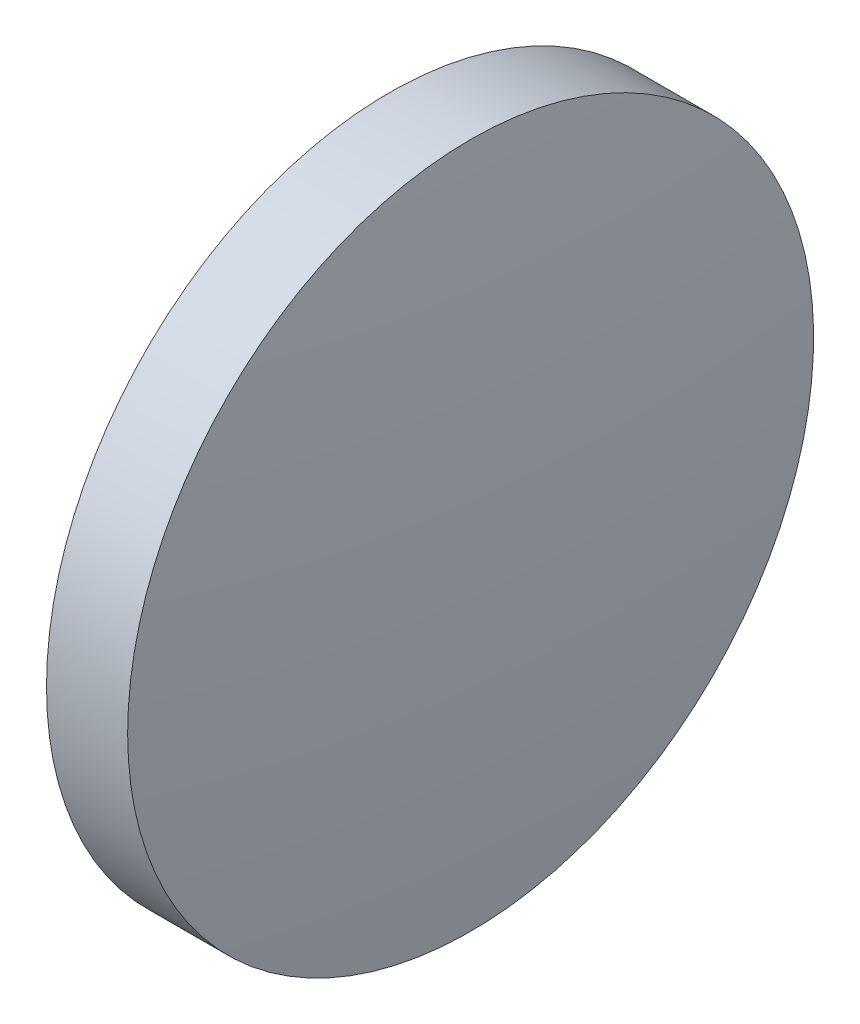
ISO-10303-21;
HEADER;
FILE_DESCRIPTION(('STEP AP214'),'2;1');
FILE_NAME('part.step','',(''),(''),'','','');
FILE_SCHEMA(('AUTOMOTIVE_DESIGN { 1 0 10303 214 1 1 1 1 }'));
ENDSEC;
DATA;
#1=APPLICATION_CONTEXT('core data for automotive mechanical design processes');
#2=APPLICATION_PROTOCOL_DEFINITION('international standard','automotive_design',2000,#1);
#3=PRODUCT_CONTEXT('',#1,'mechanical');
#4=PRODUCT('Part','Part','',(#3));
#5=PRODUCT_RELATED_PRODUCT_CATEGORY('part','',(#4));
#6=PRODUCT_DEFINITION_FORMATION('','',#4);
#7=PRODUCT_DEFINITION_CONTEXT('part definition',#1,'design');
#8=PRODUCT_DEFINITION('design','',#6,#7);
#9=PRODUCT_DEFINITION_SHAPE('','',#8);
#10=(LENGTH_UNIT() NAMED_UNIT(*) SI_UNIT(.MILLI.,.METRE.));
#11=(NAMED_UNIT(*) PLANE_ANGLE_UNIT() SI_UNIT($,.RADIAN.));
#12=(NAMED_UNIT(*) SI_UNIT($,.STERADIAN.) SOLID_ANGLE_UNIT());
#13=UNCERTAINTY_MEASURE_WITH_UNIT(LENGTH_MEASURE(1.E-05),#10,'distance_accuracy_value','');
#14=(GEOMETRIC_REPRESENTATION_CONTEXT(3) GLOBAL_UNCERTAINTY_ASSIGNED_CONTEXT((#13)) GLOBAL_UNIT_ASSIGNED_CONTEXT((#10,
#11,#12)) REPRESENTATION_CONTEXT('',''));
#15=CARTESIAN_POINT('',(0.,0.,0.));
#16=DIRECTION('',(0.,0.,1.));
#17=DIRECTION('',(1.,0.,0.));
#18=AXIS2_PLACEMENT_3D('',#15,#16,#17);
#19=CARTESIAN_POINT('',(4.88060643083813,65.2335549264122,0.));
#20=DIRECTION('',(-1.,0.,0.));
#21=DIRECTION('',(0.,1.,0.));
#22=AXIS2_PLACEMENT_3D('',#19,#20,#21);
#23=SPHERICAL_SURFACE('',#22,114.603);
#24=CARTESIAN_POINT('',(118.777742518626,65.2335549264122,0.));
#25=DIRECTION('',(-1.,0.,0.));
#26=DIRECTION('',(0.,0.,1.));
#27=AXIS2_PLACEMENT_3D('',#24,#25,#26);
#28=CIRCLE('',#27,12.7);
#29=CARTESIAN_POINT('',(118.777742518626,65.2335549264122,12.7));
#30=VERTEX_POINT('',#29);
#31=EDGE_CURVE('E10',#30,#30,#28,.T.);
#32=ORIENTED_EDGE('',*,*,#31,.F.);
#33=EDGE_LOOP('',(#32));
#34=FACE_BOUND('',#33,.T.);
#35=ADVANCED_FACE('F35',(#34),#23,.T.);
#36=CARTESIAN_POINT('',(110.165373228488,65.2335549264122,0.));
#37=DIRECTION('',(-1.,0.,0.));
#38=DIRECTION('',(0.,0.,1.));
#39=AXIS2_PLACEMENT_3D('',#36,#37,#38);
#40=CYLINDRICAL_SURFACE('',#39,12.7);
#41=CARTESIAN_POINT('',(115.773606430838,65.2335549264122,0.));
#42=DIRECTION('',(-1.,0.,0.));
#43=DIRECTION('',(0.,0.,1.));
#44=AXIS2_PLACEMENT_3D('',#41,#42,#43);
#45=CIRCLE('',#44,12.7);
#46=CARTESIAN_POINT('',(115.773606430838,65.2335549264122,12.7));
#47=VERTEX_POINT('',#46);
#48=EDGE_CURVE('E41',#47,#47,#45,.T.);
#49=ORIENTED_EDGE('',*,*,#48,.F.);
#50=EDGE_LOOP('',(#49));
#51=FACE_BOUND('',#50,.T.);
#52=ORIENTED_EDGE('',*,*,#31,.T.);
#53=EDGE_LOOP('',(#52));
#54=FACE_BOUND('',#53,.T.);
#55=ADVANCED_FACE('F49',(#51,#54),#40,.T.);
#56=CARTESIAN_POINT('',(115.773606430838,65.2335549264122,0.));
#57=DIRECTION('',(1.,0.,0.));
#58=DIRECTION('',(0.,0.,-1.));
#59=AXIS2_PLACEMENT_3D('',#56,#57,#58);
#60=PLANE('',#59);
#61=ORIENTED_EDGE('',*,*,#48,.T.);
#62=EDGE_LOOP('',(#61));
#63=FACE_BOUND('',#62,.T.);
#64=ADVANCED_FACE('F47',(#63),#60,.F.);
#65=CLOSED_SHELL('',(#35,#55,#64));
#66=MANIFOLD_SOLID_BREP('B2',#65);
#67=ADVANCED_BREP_SHAPE_REPRESENTATION('',(#18,#66),#14);
#68=SHAPE_DEFINITION_REPRESENTATION(#9,#67);
ENDSEC;
END-ISO-10303-21;
